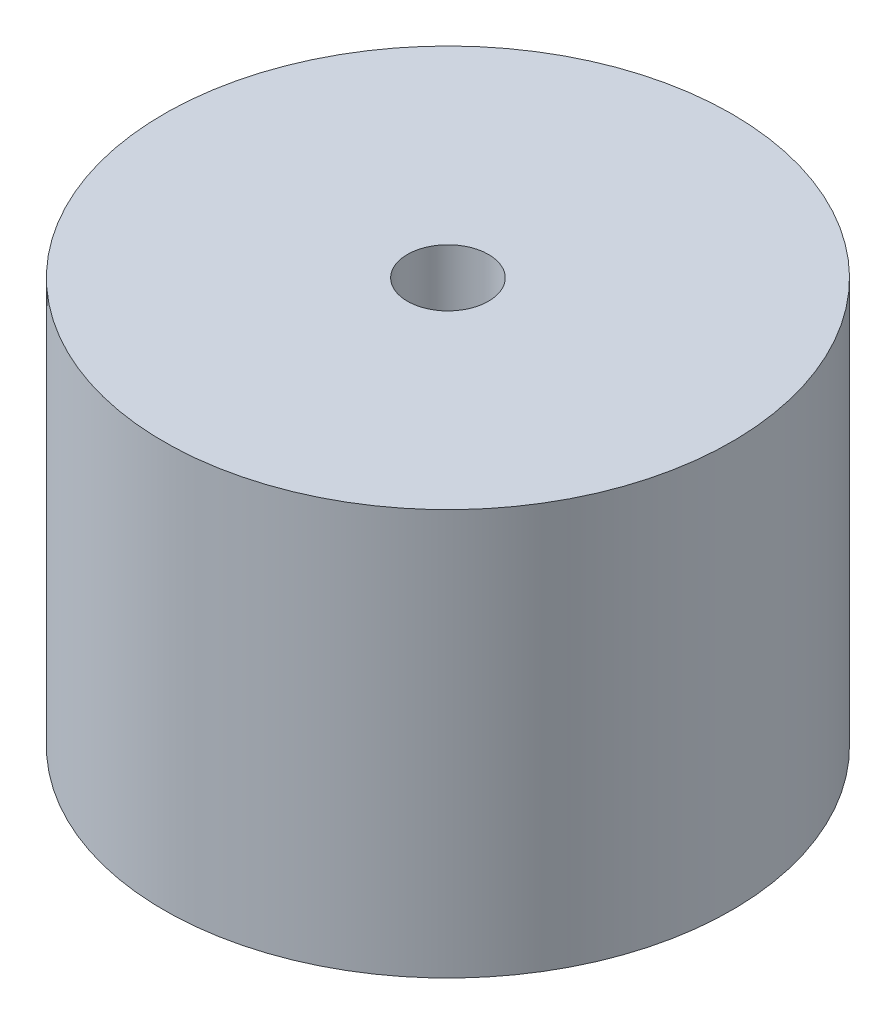
ISO-10303-21;
HEADER;
FILE_DESCRIPTION(('STEP AP214'),'2;1');
FILE_NAME('part.step','',(''),(''),'','','');
FILE_SCHEMA(('AUTOMOTIVE_DESIGN { 1 0 10303 214 1 1 1 1 }'));
ENDSEC;
DATA;
#1=APPLICATION_CONTEXT('core data for automotive mechanical design processes');
#2=APPLICATION_PROTOCOL_DEFINITION('international standard','automotive_design',2000,#1);
#3=PRODUCT_CONTEXT('',#1,'mechanical');
#4=PRODUCT('Part','Part','',(#3));
#5=PRODUCT_RELATED_PRODUCT_CATEGORY('part','',(#4));
#6=PRODUCT_DEFINITION_FORMATION('','',#4);
#7=PRODUCT_DEFINITION_CONTEXT('part definition',#1,'design');
#8=PRODUCT_DEFINITION('design','',#6,#7);
#9=PRODUCT_DEFINITION_SHAPE('','',#8);
#10=(LENGTH_UNIT() NAMED_UNIT(*) SI_UNIT(.MILLI.,.METRE.));
#11=(NAMED_UNIT(*) PLANE_ANGLE_UNIT() SI_UNIT($,.RADIAN.));
#12=(NAMED_UNIT(*) SI_UNIT($,.STERADIAN.) SOLID_ANGLE_UNIT());
#13=UNCERTAINTY_MEASURE_WITH_UNIT(LENGTH_MEASURE(1.E-05),#10,'distance_accuracy_value','');
#14=(GEOMETRIC_REPRESENTATION_CONTEXT(3) GLOBAL_UNCERTAINTY_ASSIGNED_CONTEXT((#13)) GLOBAL_UNIT_ASSIGNED_CONTEXT((#10,
#11,#12)) REPRESENTATION_CONTEXT('',''));
#15=CARTESIAN_POINT('',(0.,0.,0.));
#16=DIRECTION('',(0.,0.,1.));
#17=DIRECTION('',(1.,0.,0.));
#18=AXIS2_PLACEMENT_3D('',#15,#16,#17);
#19=CARTESIAN_POINT('',(0.,0.,0.));
#20=DIRECTION('',(0.,-1.,0.));
#21=DIRECTION('',(0.,0.,-1.));
#22=AXIS2_PLACEMENT_3D('',#19,#20,#21);
#23=CYLINDRICAL_SURFACE('',#22,41.275);
#24=CARTESIAN_POINT('',(0.,60.325,0.));
#25=DIRECTION('',(0.,-1.,0.));
#26=DIRECTION('',(0.,0.,-1.));
#27=AXIS2_PLACEMENT_3D('',#24,#25,#26);
#28=CIRCLE('',#27,41.275);
#29=CARTESIAN_POINT('',(0.,60.325,-41.275));
#30=VERTEX_POINT('',#29);
#31=EDGE_CURVE('E72',#30,#30,#28,.T.);
#32=ORIENTED_EDGE('',*,*,#31,.F.);
#33=EDGE_LOOP('',(#32));
#34=FACE_BOUND('',#33,.T.);
#35=CARTESIAN_POINT('',(0.,0.,0.));
#36=DIRECTION('',(0.,-1.,0.));
#37=DIRECTION('',(0.,0.,-1.));
#38=AXIS2_PLACEMENT_3D('',#35,#36,#37);
#39=CIRCLE('',#38,41.275);
#40=CARTESIAN_POINT('',(0.,0.,-41.275));
#41=VERTEX_POINT('',#40);
#42=EDGE_CURVE('E10',#41,#41,#39,.T.);
#43=ORIENTED_EDGE('',*,*,#42,.T.);
#44=EDGE_LOOP('',(#43));
#45=FACE_BOUND('',#44,.T.);
#46=ADVANCED_FACE('F37',(#34,#45),#23,.F.);
#47=CARTESIAN_POINT('',(-41.275,0.,0.));
#48=DIRECTION('',(0.,1.,0.));
#49=DIRECTION('',(0.,0.,1.));
#50=AXIS2_PLACEMENT_3D('',#47,#48,#49);
#51=PLANE('',#50);
#52=ORIENTED_EDGE('',*,*,#42,.F.);
#53=EDGE_LOOP('',(#52));
#54=FACE_BOUND('',#53,.T.);
#55=CARTESIAN_POINT('',(0.,0.,0.));
#56=DIRECTION('',(0.,-1.,0.));
#57=DIRECTION('',(0.,0.,-1.));
#58=AXIS2_PLACEMENT_3D('',#55,#56,#57);
#59=CIRCLE('',#58,44.45);
#60=CARTESIAN_POINT('',(0.,0.,-44.45));
#61=VERTEX_POINT('',#60);
#62=EDGE_CURVE('E44',#61,#61,#59,.T.);
#63=ORIENTED_EDGE('',*,*,#62,.T.);
#64=EDGE_LOOP('',(#63));
#65=FACE_BOUND('',#64,.T.);
#66=ADVANCED_FACE('F80',(#54,#65),#51,.F.);
#67=CARTESIAN_POINT('',(0.,0.,0.));
#68=DIRECTION('',(0.,-1.,0.));
#69=DIRECTION('',(0.,0.,-1.));
#70=AXIS2_PLACEMENT_3D('',#67,#68,#69);
#71=CYLINDRICAL_SURFACE('',#70,44.45);
#72=ORIENTED_EDGE('',*,*,#62,.F.);
#73=EDGE_LOOP('',(#72));
#74=FACE_BOUND('',#73,.T.);
#75=CARTESIAN_POINT('',(0.,63.5,0.));
#76=DIRECTION('',(0.,-1.,0.));
#77=DIRECTION('',(0.,0.,-1.));
#78=AXIS2_PLACEMENT_3D('',#75,#76,#77);
#79=CIRCLE('',#78,44.45);
#80=CARTESIAN_POINT('',(0.,63.5,-44.45));
#81=VERTEX_POINT('',#80);
#82=EDGE_CURVE('E49',#81,#81,#79,.T.);
#83=ORIENTED_EDGE('',*,*,#82,.T.);
#84=EDGE_LOOP('',(#83));
#85=FACE_BOUND('',#84,.T.);
#86=ADVANCED_FACE('F84',(#74,#85),#71,.T.);
#87=CARTESIAN_POINT('',(-44.45,63.5,0.));
#88=DIRECTION('',(0.,-1.,0.));
#89=DIRECTION('',(0.,0.,-1.));
#90=AXIS2_PLACEMENT_3D('',#87,#88,#89);
#91=PLANE('',#90);
#92=ORIENTED_EDGE('',*,*,#82,.F.);
#93=EDGE_LOOP('',(#92));
#94=FACE_BOUND('',#93,.T.);
#95=CARTESIAN_POINT('',(0.,63.5,0.));
#96=DIRECTION('',(0.,-1.,0.));
#97=DIRECTION('',(0.,0.,-1.));
#98=AXIS2_PLACEMENT_3D('',#95,#96,#97);
#99=CIRCLE('',#98,6.35);
#100=CARTESIAN_POINT('',(0.,63.5,-6.35));
#101=VERTEX_POINT('',#100);
#102=EDGE_CURVE('E54',#101,#101,#99,.T.);
#103=ORIENTED_EDGE('',*,*,#102,.T.);
#104=EDGE_LOOP('',(#103));
#105=FACE_BOUND('',#104,.T.);
#106=ADVANCED_FACE('F89',(#94,#105),#91,.F.);
#107=CARTESIAN_POINT('',(0.,0.,0.));
#108=DIRECTION('',(0.,-1.,0.));
#109=DIRECTION('',(0.,0.,-1.));
#110=AXIS2_PLACEMENT_3D('',#107,#108,#109);
#111=CYLINDRICAL_SURFACE('',#110,6.35);
#112=ORIENTED_EDGE('',*,*,#102,.F.);
#113=EDGE_LOOP('',(#112));
#114=FACE_BOUND('',#113,.T.);
#115=CARTESIAN_POINT('',(0.,38.1,0.));
#116=DIRECTION('',(0.,-1.,0.));
#117=DIRECTION('',(0.,0.,-1.));
#118=AXIS2_PLACEMENT_3D('',#115,#116,#117);
#119=CIRCLE('',#118,6.35);
#120=CARTESIAN_POINT('',(0.,38.1,-6.35));
#121=VERTEX_POINT('',#120);
#122=EDGE_CURVE('E60',#121,#121,#119,.T.);
#123=ORIENTED_EDGE('',*,*,#122,.T.);
#124=EDGE_LOOP('',(#123));
#125=FACE_BOUND('',#124,.T.);
#126=ADVANCED_FACE('F95',(#114,#125),#111,.F.);
#127=CARTESIAN_POINT('',(-9.525,38.1,0.));
#128=DIRECTION('',(0.,1.,0.));
#129=DIRECTION('',(0.,0.,1.));
#130=AXIS2_PLACEMENT_3D('',#127,#128,#129);
#131=PLANE('',#130);
#132=ORIENTED_EDGE('',*,*,#122,.F.);
#133=EDGE_LOOP('',(#132));
#134=FACE_BOUND('',#133,.T.);
#135=CARTESIAN_POINT('',(0.,38.1,0.));
#136=DIRECTION('',(0.,-1.,0.));
#137=DIRECTION('',(0.,0.,-1.));
#138=AXIS2_PLACEMENT_3D('',#135,#136,#137);
#139=CIRCLE('',#138,9.525);
#140=CARTESIAN_POINT('',(0.,38.1,-9.525));
#141=VERTEX_POINT('',#140);
#142=EDGE_CURVE('E64',#141,#141,#139,.T.);
#143=ORIENTED_EDGE('',*,*,#142,.T.);
#144=EDGE_LOOP('',(#143));
#145=FACE_BOUND('',#144,.T.);
#146=ADVANCED_FACE('F99',(#134,#145),#131,.F.);
#147=CARTESIAN_POINT('',(0.,0.,0.));
#148=DIRECTION('',(0.,-1.,0.));
#149=DIRECTION('',(0.,0.,-1.));
#150=AXIS2_PLACEMENT_3D('',#147,#148,#149);
#151=CYLINDRICAL_SURFACE('',#150,9.525);
#152=ORIENTED_EDGE('',*,*,#142,.F.);
#153=EDGE_LOOP('',(#152));
#154=FACE_BOUND('',#153,.T.);
#155=CARTESIAN_POINT('',(0.,60.325,0.));
#156=DIRECTION('',(0.,-1.,0.));
#157=DIRECTION('',(0.,0.,-1.));
#158=AXIS2_PLACEMENT_3D('',#155,#156,#157);
#159=CIRCLE('',#158,9.525);
#160=CARTESIAN_POINT('',(0.,60.325,-9.525));
#161=VERTEX_POINT('',#160);
#162=EDGE_CURVE('E68',#161,#161,#159,.T.);
#163=ORIENTED_EDGE('',*,*,#162,.T.);
#164=EDGE_LOOP('',(#163));
#165=FACE_BOUND('',#164,.T.);
#166=ADVANCED_FACE('F103',(#154,#165),#151,.T.);
#167=CARTESIAN_POINT('',(-41.275,60.325,0.));
#168=DIRECTION('',(0.,1.,0.));
#169=DIRECTION('',(0.,0.,1.));
#170=AXIS2_PLACEMENT_3D('',#167,#168,#169);
#171=PLANE('',#170);
#172=ORIENTED_EDGE('',*,*,#162,.F.);
#173=EDGE_LOOP('',(#172));
#174=FACE_BOUND('',#173,.T.);
#175=ORIENTED_EDGE('',*,*,#31,.T.);
#176=EDGE_LOOP('',(#175));
#177=FACE_BOUND('',#176,.T.);
#178=ADVANCED_FACE('F77',(#174,#177),#171,.F.);
#179=CLOSED_SHELL('',(#46,#66,#86,#106,#126,#146,#166,#178));
#180=MANIFOLD_SOLID_BREP('B2',#179);
#181=ADVANCED_BREP_SHAPE_REPRESENTATION('',(#18,#180),#14);
#182=SHAPE_DEFINITION_REPRESENTATION(#9,#181);
ENDSEC;
END-ISO-10303-21;
